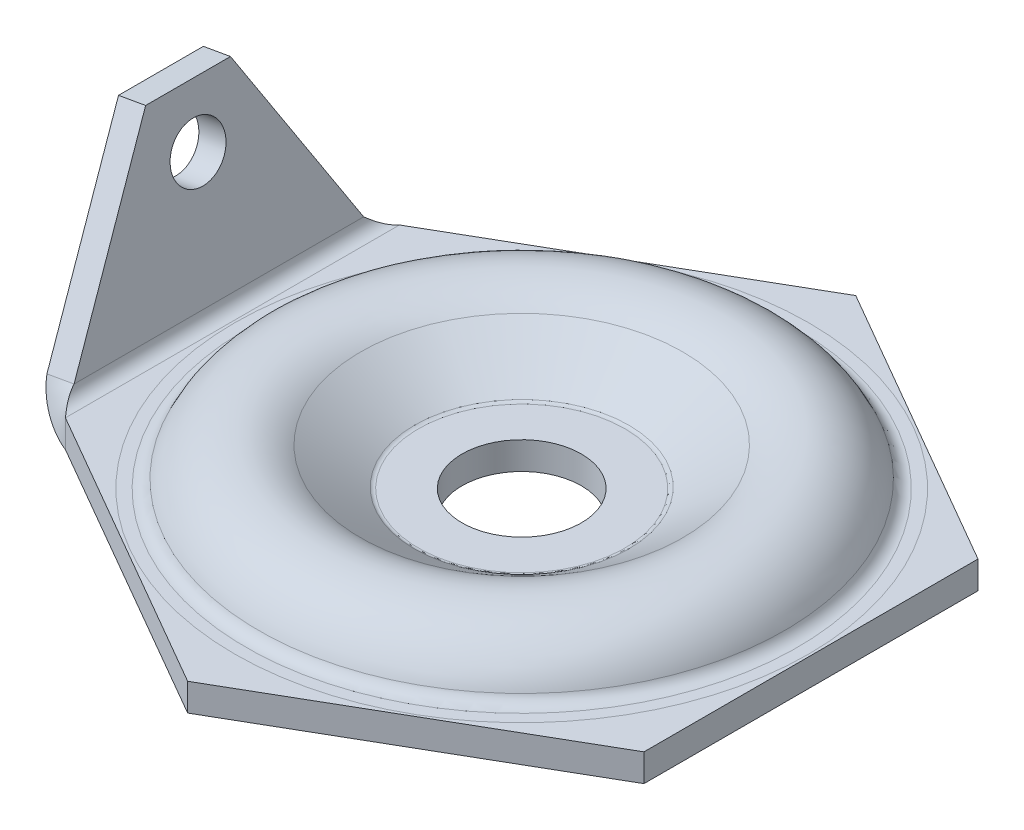
ISO-10303-21;
HEADER;
FILE_DESCRIPTION(('STEP AP214'),'2;1');
FILE_NAME('part.step','',(''),(''),'','','');
FILE_SCHEMA(('AUTOMOTIVE_DESIGN { 1 0 10303 214 1 1 1 1 }'));
ENDSEC;
DATA;
#1=APPLICATION_CONTEXT('core data for automotive mechanical design processes');
#2=APPLICATION_PROTOCOL_DEFINITION('international standard','automotive_design',2000,#1);
#3=PRODUCT_CONTEXT('',#1,'mechanical');
#4=PRODUCT('Part','Part','',(#3));
#5=PRODUCT_RELATED_PRODUCT_CATEGORY('part','',(#4));
#6=PRODUCT_DEFINITION_FORMATION('','',#4);
#7=PRODUCT_DEFINITION_CONTEXT('part definition',#1,'design');
#8=PRODUCT_DEFINITION('design','',#6,#7);
#9=PRODUCT_DEFINITION_SHAPE('','',#8);
#10=(LENGTH_UNIT() NAMED_UNIT(*) SI_UNIT(.MILLI.,.METRE.));
#11=(NAMED_UNIT(*) PLANE_ANGLE_UNIT() SI_UNIT($,.RADIAN.));
#12=(NAMED_UNIT(*) SI_UNIT($,.STERADIAN.) SOLID_ANGLE_UNIT());
#13=UNCERTAINTY_MEASURE_WITH_UNIT(LENGTH_MEASURE(1.E-05),#10,'distance_accuracy_value','');
#14=(GEOMETRIC_REPRESENTATION_CONTEXT(3) GLOBAL_UNCERTAINTY_ASSIGNED_CONTEXT((#13)) GLOBAL_UNIT_ASSIGNED_CONTEXT((#10,
#11,#12)) REPRESENTATION_CONTEXT('',''));
#15=CARTESIAN_POINT('',(0.,0.,0.));
#16=DIRECTION('',(0.,0.,1.));
#17=DIRECTION('',(1.,0.,0.));
#18=AXIS2_PLACEMENT_3D('',#15,#16,#17);
#19=CARTESIAN_POINT('',(0.,0.,0.));
#20=DIRECTION('',(0.,-1.,0.));
#21=DIRECTION('',(0.,0.,-1.));
#22=AXIS2_PLACEMENT_3D('',#19,#20,#21);
#23=CYLINDRICAL_SURFACE('',#22,13.);
#24=CARTESIAN_POINT('',(0.,0.,0.));
#25=DIRECTION('',(0.,-1.,0.));
#26=DIRECTION('',(0.,0.,-1.));
#27=AXIS2_PLACEMENT_3D('',#24,#25,#26);
#28=CIRCLE('',#27,13.);
#29=CARTESIAN_POINT('',(0.,0.,-13.));
#30=VERTEX_POINT('',#29);
#31=EDGE_CURVE('E12',#30,#30,#28,.T.);
#32=ORIENTED_EDGE('',*,*,#31,.T.);
#33=EDGE_LOOP('',(#32));
#34=FACE_BOUND('',#33,.T.);
#35=CARTESIAN_POINT('',(0.,6.,0.));
#36=DIRECTION('',(0.,-1.,0.));
#37=DIRECTION('',(0.,0.,-1.));
#38=AXIS2_PLACEMENT_3D('',#35,#36,#37);
#39=CIRCLE('',#38,13.);
#40=CARTESIAN_POINT('',(0.,6.,-13.));
#41=VERTEX_POINT('',#40);
#42=EDGE_CURVE('E121',#41,#41,#39,.T.);
#43=ORIENTED_EDGE('',*,*,#42,.F.);
#44=EDGE_LOOP('',(#43));
#45=FACE_BOUND('',#44,.T.);
#46=ADVANCED_FACE('F75',(#34,#45),#23,.F.);
#47=CARTESIAN_POINT('',(13.,0.,0.));
#48=DIRECTION('',(0.,-1.,0.));
#49=DIRECTION('',(0.,0.,-1.));
#50=AXIS2_PLACEMENT_3D('',#47,#48,#49);
#51=PLANE('',#50);
#52=CARTESIAN_POINT('',(0.,0.,0.));
#53=DIRECTION('',(0.,-1.,0.));
#54=DIRECTION('',(0.,0.,-1.));
#55=AXIS2_PLACEMENT_3D('',#52,#53,#54);
#56=CIRCLE('',#55,22.5);
#57=CARTESIAN_POINT('',(0.,0.,-22.5));
#58=VERTEX_POINT('',#57);
#59=EDGE_CURVE('E81',#58,#58,#56,.T.);
#60=ORIENTED_EDGE('',*,*,#59,.T.);
#61=EDGE_LOOP('',(#60));
#62=FACE_BOUND('',#61,.T.);
#63=ORIENTED_EDGE('',*,*,#31,.F.);
#64=EDGE_LOOP('',(#63));
#65=FACE_BOUND('',#64,.T.);
#66=ADVANCED_FACE('F129',(#62,#65),#51,.T.);
#67=CARTESIAN_POINT('',(0.,7.5,0.));
#68=DIRECTION('',(0.,-1.,0.));
#69=DIRECTION('',(0.,0.,-1.));
#70=AXIS2_PLACEMENT_3D('',#67,#68,#69);
#71=TOROIDAL_SURFACE('',#70,22.5,7.5);
#72=CARTESIAN_POINT('',(0.,1.29305055803008,0.));
#73=DIRECTION('',(0.,-1.,0.));
#74=DIRECTION('',(0.,0.,-1.));
#75=AXIS2_PLACEMENT_3D('',#72,#73,#74);
#76=CIRCLE('',#75,26.7099618317544);
#77=CARTESIAN_POINT('',(0.,1.29305055803008,-26.7099618317544));
#78=VERTEX_POINT('',#77);
#79=EDGE_CURVE('E85',#78,#78,#76,.T.);
#80=ORIENTED_EDGE('',*,*,#79,.T.);
#81=EDGE_LOOP('',(#80));
#82=FACE_BOUND('',#81,.T.);
#83=ORIENTED_EDGE('',*,*,#59,.F.);
#84=EDGE_LOOP('',(#83));
#85=FACE_BOUND('',#84,.T.);
#86=ADVANCED_FACE('F133',(#82,#85),#71,.T.);
#87=CARTESIAN_POINT('',(0.,1.29305055803008,0.));
#88=DIRECTION('',(0.,1.,0.));
#89=DIRECTION('',(0.,0.,1.));
#90=AXIS2_PLACEMENT_3D('',#87,#88,#89);
#91=CONICAL_SURFACE('',#90,26.7099618317544,0.974806450608682);
#92=CARTESIAN_POINT('',(0.,9.25459204539484,0.));
#93=DIRECTION('',(0.,-1.,0.));
#94=DIRECTION('',(0.,0.,-1.));
#95=AXIS2_PLACEMENT_3D('',#92,#93,#94);
#96=CIRCLE('',#95,38.4480458018947);
#97=CARTESIAN_POINT('',(0.,9.25459204539484,-38.4480458018947));
#98=VERTEX_POINT('',#97);
#99=EDGE_CURVE('E89',#98,#98,#96,.T.);
#100=ORIENTED_EDGE('',*,*,#99,.T.);
#101=EDGE_LOOP('',(#100));
#102=FACE_BOUND('',#101,.T.);
#103=ORIENTED_EDGE('',*,*,#79,.F.);
#104=EDGE_LOOP('',(#103));
#105=FACE_BOUND('',#104,.T.);
#106=ADVANCED_FACE('F137',(#102,#105),#91,.T.);
#107=CARTESIAN_POINT('',(0.,1.80625271503094,0.));
#108=DIRECTION('',(0.,-1.,0.));
#109=DIRECTION('',(0.,0.,-1.));
#110=AXIS2_PLACEMENT_3D('',#107,#108,#109);
#111=TOROIDAL_SURFACE('',#110,43.5,8.99999999999999);
#112=CARTESIAN_POINT('',(0.,5.40312635751546,0.));
#113=DIRECTION('',(0.,-1.,0.));
#114=DIRECTION('',(0.,0.,-1.));
#115=AXIS2_PLACEMENT_3D('',#112,#113,#114);
#116=CIRCLE('',#115,51.75);
#117=CARTESIAN_POINT('',(0.,5.40312635751546,-51.75));
#118=VERTEX_POINT('',#117);
#119=EDGE_CURVE('E94',#118,#118,#116,.T.);
#120=ORIENTED_EDGE('',*,*,#119,.T.);
#121=EDGE_LOOP('',(#120));
#122=FACE_BOUND('',#121,.T.);
#123=ORIENTED_EDGE('',*,*,#99,.F.);
#124=EDGE_LOOP('',(#123));
#125=FACE_BOUND('',#124,.T.);
#126=ADVANCED_FACE('F144',(#122,#125),#111,.F.);
#127=CARTESIAN_POINT('',(0.,9.,0.));
#128=DIRECTION('',(0.,-1.,0.));
#129=DIRECTION('',(0.,0.,-1.));
#130=AXIS2_PLACEMENT_3D('',#127,#128,#129);
#131=TOROIDAL_SURFACE('',#130,60.,9.00000000000001);
#132=CARTESIAN_POINT('',(0.,0.,0.));
#133=DIRECTION('',(0.,-1.,0.));
#134=DIRECTION('',(0.,0.,-1.));
#135=AXIS2_PLACEMENT_3D('',#132,#133,#134);
#136=CIRCLE('',#135,60.);
#137=CARTESIAN_POINT('',(0.,0.,-60.));
#138=VERTEX_POINT('',#137);
#139=EDGE_CURVE('E97',#138,#138,#136,.T.);
#140=ORIENTED_EDGE('',*,*,#139,.T.);
#141=EDGE_LOOP('',(#140));
#142=FACE_BOUND('',#141,.T.);
#143=ORIENTED_EDGE('',*,*,#119,.F.);
#144=EDGE_LOOP('',(#143));
#145=FACE_BOUND('',#144,.T.);
#146=ADVANCED_FACE('F148',(#142,#145),#131,.T.);
#147=CARTESIAN_POINT('',(60.,0.,0.));
#148=DIRECTION('',(0.,-1.,0.));
#149=DIRECTION('',(0.,0.,-1.));
#150=AXIS2_PLACEMENT_3D('',#147,#148,#149);
#151=PLANE('',#150);
#152=CARTESIAN_POINT('',(0.,0.,0.));
#153=DIRECTION('',(0.,-1.,0.));
#154=DIRECTION('',(0.,0.,-1.));
#155=AXIS2_PLACEMENT_3D('',#152,#153,#154);
#156=CIRCLE('',#155,62.5);
#157=CARTESIAN_POINT('',(0.,0.,-62.5));
#158=VERTEX_POINT('',#157);
#159=EDGE_CURVE('E100',#158,#158,#156,.T.);
#160=ORIENTED_EDGE('',*,*,#159,.T.);
#161=EDGE_LOOP('',(#160));
#162=FACE_BOUND('',#161,.T.);
#163=ORIENTED_EDGE('',*,*,#139,.F.);
#164=EDGE_LOOP('',(#163));
#165=FACE_BOUND('',#164,.T.);
#166=ADVANCED_FACE('F152',(#162,#165),#151,.T.);
#167=CARTESIAN_POINT('',(0.,0.,0.));
#168=DIRECTION('',(0.,-1.,0.));
#169=DIRECTION('',(0.,0.,-1.));
#170=AXIS2_PLACEMENT_3D('',#167,#168,#169);
#171=CYLINDRICAL_SURFACE('',#170,62.5);
#172=CARTESIAN_POINT('',(0.,6.,0.));
#173=DIRECTION('',(0.,-1.,0.));
#174=DIRECTION('',(0.,0.,-1.));
#175=AXIS2_PLACEMENT_3D('',#172,#173,#174);
#176=CIRCLE('',#175,62.5);
#177=CARTESIAN_POINT('',(0.,6.,-62.5));
#178=VERTEX_POINT('',#177);
#179=EDGE_CURVE('E103',#178,#178,#176,.T.);
#180=ORIENTED_EDGE('',*,*,#179,.T.);
#181=EDGE_LOOP('',(#180));
#182=FACE_BOUND('',#181,.T.);
#183=ORIENTED_EDGE('',*,*,#159,.F.);
#184=EDGE_LOOP('',(#183));
#185=FACE_BOUND('',#184,.T.);
#186=ADVANCED_FACE('F156',(#182,#185),#171,.T.);
#187=CARTESIAN_POINT('',(62.5,6.,0.));
#188=DIRECTION('',(0.,1.,0.));
#189=DIRECTION('',(0.,0.,1.));
#190=AXIS2_PLACEMENT_3D('',#187,#188,#189);
#191=PLANE('',#190);
#192=CARTESIAN_POINT('',(0.,6.,0.));
#193=DIRECTION('',(0.,-1.,0.));
#194=DIRECTION('',(0.,0.,-1.));
#195=AXIS2_PLACEMENT_3D('',#192,#193,#194);
#196=CIRCLE('',#195,60.);
#197=CARTESIAN_POINT('',(0.,6.,-60.));
#198=VERTEX_POINT('',#197);
#199=EDGE_CURVE('E106',#198,#198,#196,.T.);
#200=ORIENTED_EDGE('',*,*,#199,.T.);
#201=EDGE_LOOP('',(#200));
#202=FACE_BOUND('',#201,.T.);
#203=ORIENTED_EDGE('',*,*,#179,.F.);
#204=EDGE_LOOP('',(#203));
#205=FACE_BOUND('',#204,.T.);
#206=ADVANCED_FACE('F160',(#202,#205),#191,.T.);
#207=CARTESIAN_POINT('',(0.,9.,0.));
#208=DIRECTION('',(0.,-1.,0.));
#209=DIRECTION('',(0.,0.,-1.));
#210=AXIS2_PLACEMENT_3D('',#207,#208,#209);
#211=TOROIDAL_SURFACE('',#210,60.,3.);
#212=CARTESIAN_POINT('',(0.,7.80104211917182,0.));
#213=DIRECTION('',(0.,-1.,0.));
#214=DIRECTION('',(0.,0.,-1.));
#215=AXIS2_PLACEMENT_3D('',#212,#213,#214);
#216=CIRCLE('',#215,57.25);
#217=CARTESIAN_POINT('',(0.,7.80104211917182,-57.25));
#218=VERTEX_POINT('',#217);
#219=EDGE_CURVE('E109',#218,#218,#216,.T.);
#220=ORIENTED_EDGE('',*,*,#219,.T.);
#221=EDGE_LOOP('',(#220));
#222=FACE_BOUND('',#221,.T.);
#223=ORIENTED_EDGE('',*,*,#199,.F.);
#224=EDGE_LOOP('',(#223));
#225=FACE_BOUND('',#224,.T.);
#226=ADVANCED_FACE('F164',(#222,#225),#211,.F.);
#227=CARTESIAN_POINT('',(0.,1.80625271503094,0.));
#228=DIRECTION('',(0.,-1.,0.));
#229=DIRECTION('',(0.,0.,-1.));
#230=AXIS2_PLACEMENT_3D('',#227,#228,#229);
#231=TOROIDAL_SURFACE('',#230,43.5,15.);
#232=CARTESIAN_POINT('',(0.,14.2201515989708,0.));
#233=DIRECTION('',(0.,-1.,0.));
#234=DIRECTION('',(0.,0.,-1.));
#235=AXIS2_PLACEMENT_3D('',#232,#233,#234);
#236=CIRCLE('',#235,35.0800763364911);
#237=CARTESIAN_POINT('',(0.,14.2201515989708,-35.0800763364911));
#238=VERTEX_POINT('',#237);
#239=EDGE_CURVE('E112',#238,#238,#236,.T.);
#240=ORIENTED_EDGE('',*,*,#239,.T.);
#241=EDGE_LOOP('',(#240));
#242=FACE_BOUND('',#241,.T.);
#243=ORIENTED_EDGE('',*,*,#219,.F.);
#244=EDGE_LOOP('',(#243));
#245=FACE_BOUND('',#244,.T.);
#246=ADVANCED_FACE('F168',(#242,#245),#231,.T.);
#247=CARTESIAN_POINT('',(0.,14.2201515989708,0.));
#248=DIRECTION('',(0.,1.,0.));
#249=DIRECTION('',(0.,0.,1.));
#250=AXIS2_PLACEMENT_3D('',#247,#248,#249);
#251=CONICAL_SURFACE('',#250,35.0800763364911,0.974806450608682);
#252=CARTESIAN_POINT('',(0.,6.25861011160602,0.));
#253=DIRECTION('',(0.,-1.,0.));
#254=DIRECTION('',(0.,0.,-1.));
#255=AXIS2_PLACEMENT_3D('',#252,#253,#254);
#256=CIRCLE('',#255,23.3419923663509);
#257=CARTESIAN_POINT('',(0.,6.25861011160602,-23.3419923663509));
#258=VERTEX_POINT('',#257);
#259=EDGE_CURVE('E115',#258,#258,#256,.T.);
#260=ORIENTED_EDGE('',*,*,#259,.T.);
#261=EDGE_LOOP('',(#260));
#262=FACE_BOUND('',#261,.T.);
#263=ORIENTED_EDGE('',*,*,#239,.F.);
#264=EDGE_LOOP('',(#263));
#265=FACE_BOUND('',#264,.T.);
#266=ADVANCED_FACE('F172',(#262,#265),#251,.F.);
#267=CARTESIAN_POINT('',(0.,7.5,0.));
#268=DIRECTION('',(0.,-1.,0.));
#269=DIRECTION('',(0.,0.,-1.));
#270=AXIS2_PLACEMENT_3D('',#267,#268,#269);
#271=TOROIDAL_SURFACE('',#270,22.5,1.5);
#272=CARTESIAN_POINT('',(0.,6.,0.));
#273=DIRECTION('',(0.,-1.,0.));
#274=DIRECTION('',(0.,0.,-1.));
#275=AXIS2_PLACEMENT_3D('',#272,#273,#274);
#276=CIRCLE('',#275,22.5);
#277=CARTESIAN_POINT('',(0.,6.,-22.5));
#278=VERTEX_POINT('',#277);
#279=EDGE_CURVE('E118',#278,#278,#276,.T.);
#280=ORIENTED_EDGE('',*,*,#279,.T.);
#281=EDGE_LOOP('',(#280));
#282=FACE_BOUND('',#281,.T.);
#283=ORIENTED_EDGE('',*,*,#259,.F.);
#284=EDGE_LOOP('',(#283));
#285=FACE_BOUND('',#284,.T.);
#286=ADVANCED_FACE('F176',(#282,#285),#271,.F.);
#287=CARTESIAN_POINT('',(13.,6.,0.));
#288=DIRECTION('',(0.,1.,0.));
#289=DIRECTION('',(0.,0.,1.));
#290=AXIS2_PLACEMENT_3D('',#287,#288,#289);
#291=PLANE('',#290);
#292=ORIENTED_EDGE('',*,*,#42,.T.);
#293=EDGE_LOOP('',(#292));
#294=FACE_BOUND('',#293,.T.);
#295=ORIENTED_EDGE('',*,*,#279,.F.);
#296=EDGE_LOOP('',(#295));
#297=FACE_BOUND('',#296,.T.);
#298=ADVANCED_FACE('F125',(#294,#297),#291,.T.);
#299=CLOSED_SHELL('',(#46,#66,#86,#106,#126,#146,#166,#186,#206,#226,#246,#266,#286,#298));
#300=MANIFOLD_SOLID_BREP('B2',#299);
#301=CARTESIAN_POINT('',(-53.5598364946397,-61.8141391116004,0.));
#302=DIRECTION('',(0.984807753012209,0.173648177666927,0.));
#303=DIRECTION('',(0.,0.,1.));
#304=AXIS2_PLACEMENT_3D('',#301,#302,#303);
#305=PLANE('',#304);
#306=CARTESIAN_POINT('',(-70.4905338171652,34.20461680709,0.));
#307=DIRECTION('',(0.984807753012209,0.173648177666927,0.));
#308=DIRECTION('',(0.,0.,1.));
#309=AXIS2_PLACEMENT_3D('',#306,#307,#308);
#310=CIRCLE('',#309,6.);
#311=CARTESIAN_POINT('',(-70.4905338171652,34.20461680709,6.00000000000002));
#312=VERTEX_POINT('',#311);
#313=EDGE_CURVE('E391',#312,#312,#310,.T.);
#314=ORIENTED_EDGE('',*,*,#313,.F.);
#315=EDGE_LOOP('',(#314));
#316=FACE_BOUND('',#315,.T.);
#317=DIRECTION('',(0.150383733180433,-0.852868531952444,0.5));
#318=VECTOR('',#317,1.);
#319=CARTESIAN_POINT('',(-64.4996716876562,0.228749328168756,36.3730669589464));
#320=LINE('',#319,#318);
#321=CARTESIAN_POINT('',(-72.6611360380018,46.5147137197426,9.23760430703401));
#322=VERTEX_POINT('',#321);
#323=CARTESIAN_POINT('',(-65.9544232590366,8.47905546699922,31.5362686543219));
#324=VERTEX_POINT('',#323);
#325=EDGE_CURVE('E349',#322,#324,#320,.T.);
#326=ORIENTED_EDGE('',*,*,#325,.T.);
#327=DIRECTION('',(0.,0.,-1.));
#328=VECTOR('',#327,1.);
#329=CARTESIAN_POINT('',(-65.9544232590366,8.47905546699922,0.));
#330=LINE('',#329,#328);
#331=CARTESIAN_POINT('',(-65.9544232590366,8.4790554669992,-31.5362686543218));
#332=VERTEX_POINT('',#331);
#333=EDGE_CURVE('E351',#324,#332,#330,.T.);
#334=ORIENTED_EDGE('',*,*,#333,.T.);
#335=DIRECTION('',(-0.150383733180433,0.852868531952443,0.5));
#336=VECTOR('',#335,1.);
#337=CARTESIAN_POINT('',(-53.5598364946397,-61.8141391116004,-72.7461339178929));
#338=LINE('',#337,#336);
#339=CARTESIAN_POINT('',(-72.6611360380018,46.5147137197426,-9.23760430703401));
#340=VERTEX_POINT('',#339);
#341=EDGE_CURVE('E337',#332,#340,#338,.T.);
#342=ORIENTED_EDGE('',*,*,#341,.T.);
#343=DIRECTION('',(0.,0.,1.));
#344=VECTOR('',#343,1.);
#345=CARTESIAN_POINT('',(-72.6611360380018,46.5147137197426,9.23760430703401));
#346=LINE('',#345,#344);
#347=EDGE_CURVE('E313',#340,#322,#346,.T.);
#348=ORIENTED_EDGE('',*,*,#347,.T.);
#349=EDGE_LOOP('',(#326,#334,#342,#348));
#350=FACE_BOUND('',#349,.T.);
#351=ADVANCED_FACE('F287',(#316,#350),#305,.T.);
#352=CARTESIAN_POINT('',(-59.468683012713,-62.856028177602,0.));
#353=DIRECTION('',(0.984807753012209,0.173648177666927,0.));
#354=DIRECTION('',(0.,0.,1.));
#355=AXIS2_PLACEMENT_3D('',#352,#353,#354);
#356=PLANE('',#355);
#357=CARTESIAN_POINT('',(-76.3993803352384,33.1627277410884,0.));
#358=DIRECTION('',(0.984807753012209,0.173648177666927,0.));
#359=DIRECTION('',(0.,0.,1.));
#360=AXIS2_PLACEMENT_3D('',#357,#358,#359);
#361=CIRCLE('',#360,6.);
#362=CARTESIAN_POINT('',(-76.3993803352384,33.1627277410884,6.00000000000002));
#363=VERTEX_POINT('',#362);
#364=EDGE_CURVE('E389',#363,#363,#361,.T.);
#365=ORIENTED_EDGE('',*,*,#364,.T.);
#366=EDGE_LOOP('',(#365));
#367=FACE_BOUND('',#366,.T.);
#368=DIRECTION('',(0.,0.,-1.));
#369=VECTOR('',#368,1.);
#370=CARTESIAN_POINT('',(-71.8632697771099,7.43716640099763,0.));
#371=LINE('',#370,#369);
#372=CARTESIAN_POINT('',(-71.8632697771099,7.43716640099765,31.5362686543219));
#373=VERTEX_POINT('',#372);
#374=CARTESIAN_POINT('',(-71.8632697771099,7.43716640099765,-31.5362686543218));
#375=VERTEX_POINT('',#374);
#376=EDGE_CURVE('E297',#373,#375,#371,.T.);
#377=ORIENTED_EDGE('',*,*,#376,.F.);
#378=DIRECTION('',(0.150383733180433,-0.852868531952444,0.5));
#379=VECTOR('',#378,1.);
#380=CARTESIAN_POINT('',(-70.4085182057294,-0.813139737832813,36.3730669589464));
#381=LINE('',#380,#379);
#382=CARTESIAN_POINT('',(-78.569982556075,45.472824653741,9.23760430703401));
#383=VERTEX_POINT('',#382);
#384=EDGE_CURVE('E327',#383,#373,#381,.T.);
#385=ORIENTED_EDGE('',*,*,#384,.F.);
#386=DIRECTION('',(0.,0.,1.));
#387=VECTOR('',#386,1.);
#388=CARTESIAN_POINT('',(-78.569982556075,45.472824653741,9.23760430703401));
#389=LINE('',#388,#387);
#390=CARTESIAN_POINT('',(-78.569982556075,45.472824653741,-9.23760430703401));
#391=VERTEX_POINT('',#390);
#392=EDGE_CURVE('E331',#391,#383,#389,.T.);
#393=ORIENTED_EDGE('',*,*,#392,.F.);
#394=DIRECTION('',(-0.150383733180433,0.852868531952444,0.5));
#395=VECTOR('',#394,1.);
#396=CARTESIAN_POINT('',(-70.4085182057294,-0.813139737832813,-36.3730669589464));
#397=LINE('',#396,#395);
#398=EDGE_CURVE('E346',#375,#391,#397,.T.);
#399=ORIENTED_EDGE('',*,*,#398,.F.);
#400=EDGE_LOOP('',(#377,#385,#393,#399));
#401=FACE_BOUND('',#400,.T.);
#402=ADVANCED_FACE('F329',(#367,#401),#356,.F.);
#403=CARTESIAN_POINT('',(-64.4996716876562,0.228749328168756,-36.3730669589464));
#404=DIRECTION('',(0.0868240888334637,-0.492403876506104,0.866025403784439));
#405=DIRECTION('',(0.150383733180433,-0.852868531952444,-0.5));
#406=AXIS2_PLACEMENT_3D('',#403,#404,#405);
#407=PLANE('',#406);
#408=CARTESIAN_POINT('',(-71.8632697771099,7.43716640099764,-31.5362686543218));
#409=CARTESIAN_POINT('',(-65.9544232590366,8.47905546699921,-31.5362686543218));
#410=B_SPLINE_CURVE_WITH_KNOTS('',1,(#408,#409),.UNSPECIFIED.,.F.,.F.,(2,2),(0.,1.),.UNSPECIFIED.);
#411=EDGE_CURVE('E73',#375,#332,#410,.T.);
#412=ORIENTED_EDGE('',*,*,#411,.F.);
#413=ORIENTED_EDGE('',*,*,#398,.T.);
#414=DIRECTION('',(-0.984807753012209,-0.173648177666927,0.));
#415=VECTOR('',#414,1.);
#416=CARTESIAN_POINT('',(-72.6611360380018,46.5147137197426,-9.23760430703401));
#417=LINE('',#416,#415);
#418=EDGE_CURVE('E345',#340,#391,#417,.T.);
#419=ORIENTED_EDGE('',*,*,#418,.F.);
#420=ORIENTED_EDGE('',*,*,#341,.F.);
#421=EDGE_LOOP('',(#412,#413,#419,#420));
#422=FACE_BOUND('',#421,.T.);
#423=ADVANCED_FACE('F289',(#422),#407,.F.);
#424=CARTESIAN_POINT('',(-72.6611360380018,46.5147137197426,9.23760430703401));
#425=DIRECTION('',(0.173648177666927,-0.984807753012209,0.));
#426=DIRECTION('',(0.,0.,-1.));
#427=AXIS2_PLACEMENT_3D('',#424,#425,#426);
#428=PLANE('',#427);
#429=ORIENTED_EDGE('',*,*,#392,.T.);
#430=DIRECTION('',(-0.984807753012209,-0.173648177666927,0.));
#431=VECTOR('',#430,1.);
#432=CARTESIAN_POINT('',(-72.6611360380018,46.5147137197426,9.23760430703401));
#433=LINE('',#432,#431);
#434=EDGE_CURVE('E342',#322,#383,#433,.T.);
#435=ORIENTED_EDGE('',*,*,#434,.F.);
#436=ORIENTED_EDGE('',*,*,#347,.F.);
#437=ORIENTED_EDGE('',*,*,#418,.T.);
#438=EDGE_LOOP('',(#429,#435,#436,#437));
#439=FACE_BOUND('',#438,.T.);
#440=ADVANCED_FACE('F341',(#439),#428,.F.);
#441=CARTESIAN_POINT('',(-64.4996716876562,0.228749328168756,36.3730669589464));
#442=DIRECTION('',(0.0868240888334637,-0.492403876506104,-0.866025403784438));
#443=DIRECTION('',(-0.150383733180433,0.852868531952444,-0.5));
#444=AXIS2_PLACEMENT_3D('',#441,#442,#443);
#445=PLANE('',#444);
#446=CARTESIAN_POINT('',(-65.9544232590366,8.47905546699922,31.5362686543219));
#447=CARTESIAN_POINT('',(-71.8632697771099,7.43716640099765,31.5362686543219));
#448=B_SPLINE_CURVE_WITH_KNOTS('',1,(#446,#447),.UNSPECIFIED.,.F.,.F.,(2,2),(0.,1.),.UNSPECIFIED.);
#449=EDGE_CURVE('E364',#373,#324,#448,.F.);
#450=ORIENTED_EDGE('',*,*,#449,.T.);
#451=ORIENTED_EDGE('',*,*,#325,.F.);
#452=ORIENTED_EDGE('',*,*,#434,.T.);
#453=ORIENTED_EDGE('',*,*,#384,.T.);
#454=EDGE_LOOP('',(#450,#451,#452,#453));
#455=FACE_BOUND('',#454,.T.);
#456=ADVANCED_FACE('F348',(#455),#445,.F.);
#457=CARTESIAN_POINT('',(-76.4141770717274,33.1601186772189,0.));
#458=DIRECTION('',(0.984807753012209,0.173648177666927,0.));
#459=DIRECTION('',(0.,0.,1.));
#460=AXIS2_PLACEMENT_3D('',#457,#458,#459);
#461=CYLINDRICAL_SURFACE('',#460,6.);
#462=ORIENTED_EDGE('',*,*,#313,.T.);
#463=EDGE_LOOP('',(#462));
#464=FACE_BOUND('',#463,.T.);
#465=ORIENTED_EDGE('',*,*,#364,.F.);
#466=EDGE_LOOP('',(#465));
#467=FACE_BOUND('',#466,.T.);
#468=ADVANCED_FACE('F377',(#464,#467),#461,.F.);
#469=CARTESIAN_POINT('',(0.,6.,0.));
#470=DIRECTION('',(0.,-1.,0.));
#471=DIRECTION('',(0.,0.,-1.));
#472=AXIS2_PLACEMENT_3D('',#469,#470,#471);
#473=CYLINDRICAL_SURFACE('',#472,62.5);
#474=CARTESIAN_POINT('',(0.,6.,0.));
#475=DIRECTION('',(0.,1.,0.));
#476=DIRECTION('',(0.,0.,1.));
#477=AXIS2_PLACEMENT_3D('',#474,#475,#476);
#478=CIRCLE('',#477,62.5);
#479=CARTESIAN_POINT('',(0.,6.,62.5));
#480=VERTEX_POINT('',#479);
#481=EDGE_CURVE('E615',#480,#480,#478,.T.);
#482=ORIENTED_EDGE('',*,*,#481,.T.);
#483=EDGE_LOOP('',(#482));
#484=FACE_BOUND('',#483,.T.);
#485=CARTESIAN_POINT('',(0.,0.,0.));
#486=DIRECTION('',(0.,1.,0.));
#487=DIRECTION('',(0.,0.,1.));
#488=AXIS2_PLACEMENT_3D('',#485,#486,#487);
#489=CIRCLE('',#488,62.5);
#490=CARTESIAN_POINT('',(0.,0.,62.5));
#491=VERTEX_POINT('',#490);
#492=EDGE_CURVE('E569',#491,#491,#489,.T.);
#493=ORIENTED_EDGE('',*,*,#492,.F.);
#494=EDGE_LOOP('',(#493));
#495=FACE_BOUND('',#494,.T.);
#496=ADVANCED_FACE('F710',(#484,#495),#473,.F.);
#497=CARTESIAN_POINT('',(63.,6.,-36.3730669589464));
#498=DIRECTION('',(-0.5,0.,0.866025403784439));
#499=DIRECTION('',(0.866025403784439,0.,0.5));
#500=AXIS2_PLACEMENT_3D('',#497,#498,#499);
#501=PLANE('',#500);
#502=DIRECTION('',(-0.866025403784439,0.,-0.5));
#503=VECTOR('',#502,1.);
#504=CARTESIAN_POINT('',(63.,0.,-36.3730669589464));
#505=LINE('',#504,#503);
#506=CARTESIAN_POINT('',(63.,0.,-36.3730669589464));
#507=VERTEX_POINT('',#506);
#508=CARTESIAN_POINT('',(0.,0.,-72.7461339178929));
#509=VERTEX_POINT('',#508);
#510=EDGE_CURVE('E612',#507,#509,#505,.T.);
#511=ORIENTED_EDGE('',*,*,#510,.T.);
#512=DIRECTION('',(0.,-1.,0.));
#513=VECTOR('',#512,1.);
#514=CARTESIAN_POINT('',(0.,6.,-72.7461339178929));
#515=LINE('',#514,#513);
#516=CARTESIAN_POINT('',(0.,6.,-72.7461339178929));
#517=VERTEX_POINT('',#516);
#518=EDGE_CURVE('E395',#517,#509,#515,.T.);
#519=ORIENTED_EDGE('',*,*,#518,.F.);
#520=DIRECTION('',(-0.866025403784439,0.,-0.5));
#521=VECTOR('',#520,1.);
#522=CARTESIAN_POINT('',(63.,6.,-36.3730669589464));
#523=LINE('',#522,#521);
#524=CARTESIAN_POINT('',(63.,6.,-36.3730669589464));
#525=VERTEX_POINT('',#524);
#526=EDGE_CURVE('E581',#525,#517,#523,.T.);
#527=ORIENTED_EDGE('',*,*,#526,.F.);
#528=DIRECTION('',(0.,-1.,0.));
#529=VECTOR('',#528,1.);
#530=CARTESIAN_POINT('',(63.,6.,-36.3730669589464));
#531=LINE('',#530,#529);
#532=EDGE_CURVE('E609',#525,#507,#531,.T.);
#533=ORIENTED_EDGE('',*,*,#532,.T.);
#534=EDGE_LOOP('',(#511,#519,#527,#533));
#535=FACE_BOUND('',#534,.T.);
#536=ADVANCED_FACE('F702',(#535),#501,.F.);
#537=CARTESIAN_POINT('',(63.,6.,36.3730669589464));
#538=DIRECTION('',(-1.,0.,0.));
#539=DIRECTION('',(0.,0.,1.));
#540=AXIS2_PLACEMENT_3D('',#537,#538,#539);
#541=PLANE('',#540);
#542=DIRECTION('',(0.,0.,-1.));
#543=VECTOR('',#542,1.);
#544=CARTESIAN_POINT('',(63.,0.,36.3730669589464));
#545=LINE('',#544,#543);
#546=CARTESIAN_POINT('',(63.,0.,36.3730669589464));
#547=VERTEX_POINT('',#546);
#548=EDGE_CURVE('E606',#547,#507,#545,.T.);
#549=ORIENTED_EDGE('',*,*,#548,.T.);
#550=ORIENTED_EDGE('',*,*,#532,.F.);
#551=DIRECTION('',(0.,0.,-1.));
#552=VECTOR('',#551,1.);
#553=CARTESIAN_POINT('',(63.,6.,36.3730669589464));
#554=LINE('',#553,#552);
#555=CARTESIAN_POINT('',(63.,6.,36.3730669589464));
#556=VERTEX_POINT('',#555);
#557=EDGE_CURVE('E586',#556,#525,#554,.T.);
#558=ORIENTED_EDGE('',*,*,#557,.F.);
#559=DIRECTION('',(0.,-1.,0.));
#560=VECTOR('',#559,1.);
#561=CARTESIAN_POINT('',(63.,6.,36.3730669589464));
#562=LINE('',#561,#560);
#563=EDGE_CURVE('E603',#556,#547,#562,.T.);
#564=ORIENTED_EDGE('',*,*,#563,.T.);
#565=EDGE_LOOP('',(#549,#550,#558,#564));
#566=FACE_BOUND('',#565,.T.);
#567=ADVANCED_FACE('F695',(#566),#541,.F.);
#568=CARTESIAN_POINT('',(0.,6.,72.7461339178929));
#569=DIRECTION('',(-0.5,0.,-0.866025403784439));
#570=DIRECTION('',(-0.866025403784439,0.,0.5));
#571=AXIS2_PLACEMENT_3D('',#568,#569,#570);
#572=PLANE('',#571);
#573=DIRECTION('',(0.866025403784439,0.,-0.5));
#574=VECTOR('',#573,1.);
#575=CARTESIAN_POINT('',(0.,0.,72.7461339178929));
#576=LINE('',#575,#574);
#577=CARTESIAN_POINT('',(0.,0.,72.7461339178929));
#578=VERTEX_POINT('',#577);
#579=EDGE_CURVE('E600',#578,#547,#576,.T.);
#580=ORIENTED_EDGE('',*,*,#579,.T.);
#581=ORIENTED_EDGE('',*,*,#563,.F.);
#582=DIRECTION('',(0.866025403784439,0.,-0.5));
#583=VECTOR('',#582,1.);
#584=CARTESIAN_POINT('',(0.,6.,72.7461339178929));
#585=LINE('',#584,#583);
#586=CARTESIAN_POINT('',(0.,6.,72.7461339178929));
#587=VERTEX_POINT('',#586);
#588=EDGE_CURVE('E589',#587,#556,#585,.T.);
#589=ORIENTED_EDGE('',*,*,#588,.F.);
#590=DIRECTION('',(0.,-1.,0.));
#591=VECTOR('',#590,1.);
#592=CARTESIAN_POINT('',(0.,6.,72.7461339178929));
#593=LINE('',#592,#591);
#594=EDGE_CURVE('E595',#587,#578,#593,.T.);
#595=ORIENTED_EDGE('',*,*,#594,.T.);
#596=EDGE_LOOP('',(#580,#581,#589,#595));
#597=FACE_BOUND('',#596,.T.);
#598=ADVANCED_FACE('F689',(#597),#572,.F.);
#599=CARTESIAN_POINT('',(0.,6.,0.));
#600=DIRECTION('',(0.,1.,0.));
#601=DIRECTION('',(0.,0.,1.));
#602=AXIS2_PLACEMENT_3D('',#599,#600,#601);
#603=PLANE('',#602);
#604=DIRECTION('',(0.,0.,-1.));
#605=VECTOR('',#604,1.);
#606=CARTESIAN_POINT('',(-63.,6.,0.));
#607=LINE('',#606,#605);
#608=CARTESIAN_POINT('',(-63.,6.,36.3730669589464));
#609=VERTEX_POINT('',#608);
#610=CARTESIAN_POINT('',(-63.,6.,-36.3730669589464));
#611=VERTEX_POINT('',#610);
#612=EDGE_CURVE('E618',#609,#611,#607,.T.);
#613=ORIENTED_EDGE('',*,*,#612,.F.);
#614=DIRECTION('',(0.866025403784439,0.,0.5));
#615=VECTOR('',#614,1.);
#616=CARTESIAN_POINT('',(-63.,6.,36.3730669589464));
#617=LINE('',#616,#615);
#618=EDGE_CURVE('E592',#609,#587,#617,.T.);
#619=ORIENTED_EDGE('',*,*,#618,.T.);
#620=ORIENTED_EDGE('',*,*,#588,.T.);
#621=ORIENTED_EDGE('',*,*,#557,.T.);
#622=ORIENTED_EDGE('',*,*,#526,.T.);
#623=DIRECTION('',(-0.866025403784438,0.,0.5));
#624=VECTOR('',#623,1.);
#625=CARTESIAN_POINT('',(0.,6.,-72.7461339178929));
#626=LINE('',#625,#624);
#627=EDGE_CURVE('E576',#517,#611,#626,.T.);
#628=ORIENTED_EDGE('',*,*,#627,.T.);
#629=EDGE_LOOP('',(#613,#619,#620,#621,#622,#628));
#630=FACE_BOUND('',#629,.T.);
#631=ORIENTED_EDGE('',*,*,#481,.F.);
#632=EDGE_LOOP('',(#631));
#633=FACE_BOUND('',#632,.T.);
#634=ADVANCED_FACE('F542',(#630,#633),#603,.T.);
#635=CARTESIAN_POINT('',(-63.,6.,36.3730669589464));
#636=DIRECTION('',(0.5,0.,-0.866025403784438));
#637=DIRECTION('',(-0.866025403784439,0.,-0.5));
#638=AXIS2_PLACEMENT_3D('',#635,#636,#637);
#639=PLANE('',#638);
#640=ORIENTED_EDGE('',*,*,#618,.F.);
#641=CARTESIAN_POINT('',(-63.,0.,36.3730669589464));
#642=CARTESIAN_POINT('',(-63.,6.,36.3730669589464));
#643=B_SPLINE_CURVE_WITH_KNOTS('',1,(#641,#642),.UNSPECIFIED.,.F.,.F.,(2,2),(0.,1.),.UNSPECIFIED.);
#644=CARTESIAN_POINT('',(-63.,0.,36.3730669589465));
#645=VERTEX_POINT('',#644);
#646=EDGE_CURVE('E447',#645,#609,#643,.T.);
#647=ORIENTED_EDGE('',*,*,#646,.F.);
#648=DIRECTION('',(0.866025403784439,0.,0.5));
#649=VECTOR('',#648,1.);
#650=CARTESIAN_POINT('',(-63.,0.,36.3730669589464));
#651=LINE('',#650,#649);
#652=EDGE_CURVE('E574',#645,#578,#651,.T.);
#653=ORIENTED_EDGE('',*,*,#652,.T.);
#654=ORIENTED_EDGE('',*,*,#594,.F.);
#655=EDGE_LOOP('',(#640,#647,#653,#654));
#656=FACE_BOUND('',#655,.T.);
#657=ADVANCED_FACE('F531',(#656),#639,.F.);
#658=CARTESIAN_POINT('',(0.,0.,0.));
#659=DIRECTION('',(0.,1.,0.));
#660=DIRECTION('',(0.,0.,1.));
#661=AXIS2_PLACEMENT_3D('',#658,#659,#660);
#662=PLANE('',#661);
#663=ORIENTED_EDGE('',*,*,#492,.T.);
#664=EDGE_LOOP('',(#663));
#665=FACE_BOUND('',#664,.T.);
#666=ORIENTED_EDGE('',*,*,#652,.F.);
#667=DIRECTION('',(0.,0.,-1.));
#668=VECTOR('',#667,1.);
#669=CARTESIAN_POINT('',(-63.,0.,0.));
#670=LINE('',#669,#668);
#671=CARTESIAN_POINT('',(-63.,0.,-36.3730669589464));
#672=VERTEX_POINT('',#671);
#673=EDGE_CURVE('E564',#645,#672,#670,.T.);
#674=ORIENTED_EDGE('',*,*,#673,.T.);
#675=DIRECTION('',(-0.866025403784439,0.,0.5));
#676=VECTOR('',#675,1.);
#677=CARTESIAN_POINT('',(-63.,0.,-36.3730669589464));
#678=LINE('',#677,#676);
#679=EDGE_CURVE('E561',#509,#672,#678,.T.);
#680=ORIENTED_EDGE('',*,*,#679,.F.);
#681=ORIENTED_EDGE('',*,*,#510,.F.);
#682=ORIENTED_EDGE('',*,*,#548,.F.);
#683=ORIENTED_EDGE('',*,*,#579,.F.);
#684=EDGE_LOOP('',(#666,#674,#680,#681,#682,#683));
#685=FACE_BOUND('',#684,.T.);
#686=ADVANCED_FACE('F541',(#665,#685),#662,.F.);
#687=CARTESIAN_POINT('',(-63.,6.,-36.3730669589464));
#688=DIRECTION('',(0.5,0.,0.866025403784439));
#689=DIRECTION('',(0.866025403784439,0.,-0.5));
#690=AXIS2_PLACEMENT_3D('',#687,#688,#689);
#691=PLANE('',#690);
#692=ORIENTED_EDGE('',*,*,#679,.T.);
#693=CARTESIAN_POINT('',(-63.,6.,-36.3730669589464));
#694=CARTESIAN_POINT('',(-63.,0.,-36.3730669589464));
#695=B_SPLINE_CURVE_WITH_KNOTS('',1,(#693,#694),.UNSPECIFIED.,.F.,.F.,(2,2),(0.,1.),.UNSPECIFIED.);
#696=EDGE_CURVE('E426',#672,#611,#695,.F.);
#697=ORIENTED_EDGE('',*,*,#696,.T.);
#698=ORIENTED_EDGE('',*,*,#627,.F.);
#699=ORIENTED_EDGE('',*,*,#518,.T.);
#700=EDGE_LOOP('',(#692,#697,#698,#699));
#701=FACE_BOUND('',#700,.T.);
#702=ADVANCED_FACE('F470',(#701),#691,.F.);
#703=CARTESIAN_POINT('',(-71.8632697771099,7.43716640099765,31.5362686543219));
#704=CARTESIAN_POINT('',(-71.6814079703803,6.4057768428097,31.9393747680026));
#705=CARTESIAN_POINT('',(-71.3178274096582,5.40689968211713,32.3424017050926));
#706=CARTESIAN_POINT('',(-70.2706298584617,3.5931003178829,33.1485347558634));
#707=CARTESIAN_POINT('',(-69.5872883521208,2.77872562273246,33.5516012812488));
#708=CARTESIAN_POINT('',(-67.9828886222369,1.43247440112594,34.3577343320195));
#709=CARTESIAN_POINT('',(-67.0622251012955,0.900929069477378,34.7608008574049));
#710=CARTESIAN_POINT('',(-65.0941374785665,0.184603756376276,35.5669339081757));
#711=CARTESIAN_POINT('',(-64.0473004046052,0.,35.9699608452657));
#712=CARTESIAN_POINT('',(-63.,0.,36.3730669589464));
#713=CARTESIAN_POINT('',(-65.9544232590366,8.47905546699922,31.5362686543219));
#714=CARTESIAN_POINT('',(-65.8938056807608,8.1352760973741,31.9393546596621));
#715=CARTESIAN_POINT('',(-65.7726091365527,7.80229989403904,32.3424017050926));
#716=CARTESIAN_POINT('',(-65.4235432861539,7.19770010596097,33.1485347558634));
#717=CARTESIAN_POINT('',(-65.1957627840403,6.92624187424416,33.5516012812488));
#718=CARTESIAN_POINT('',(-64.660962874079,6.47749146704198,34.3577343320195));
#719=CARTESIAN_POINT('',(-64.3540750337652,6.30030968982579,34.7608008574049));
#720=CARTESIAN_POINT('',(-63.6980458261888,6.06153458545876,35.5669339081757));
#721=CARTESIAN_POINT('',(-63.3490827205346,6.,35.9699809536062));
#722=CARTESIAN_POINT('',(-63.,6.,36.3730669589464));
#723=B_SPLINE_SURFACE_WITH_KNOTS('',1,3,((#703,#704,#705,#706,#707,#708,#709,#710,#711,#712),
(#713,#714,#715,#716,#717,#718,#719,#720,#721,#722)),.UNSPECIFIED.,.F.,.F.,.F.,(2,2),(4,2,2,2,
4),(0.,1.),(0.,0.25,0.5,0.75,1.),.UNSPECIFIED.);
#724=CARTESIAN_POINT('',(-71.8632697771099,7.43716640099765,31.5362686543219));
#725=CARTESIAN_POINT('',(-71.6814079703803,6.4057768428097,31.9393747680026));
#726=CARTESIAN_POINT('',(-71.3178274096582,5.40689968211713,32.3424017050926));
#727=CARTESIAN_POINT('',(-70.2706298584617,3.5931003178829,33.1485347558634));
#728=CARTESIAN_POINT('',(-69.5872883521208,2.77872562273246,33.5516012812488));
#729=CARTESIAN_POINT('',(-67.9828886222369,1.43247440112594,34.3577343320195));
#730=CARTESIAN_POINT('',(-67.0622251012955,0.900929069477378,34.7608008574049));
#731=CARTESIAN_POINT('',(-65.0941374785665,0.184603756376276,35.5669339081757));
#732=CARTESIAN_POINT('',(-64.0473004046052,0.,35.9699608452657));
#733=CARTESIAN_POINT('',(-63.,0.,36.3730669589464));
#734=B_SPLINE_CURVE_WITH_KNOTS('',3,(#724,#725,#726,#727,#728,#729,#730,#731,#732,#733),
.UNSPECIFIED.,.F.,.F.,(4,2,2,2,4),(0.,0.25,0.5,0.75,1.),.UNSPECIFIED.);
#735=EDGE_CURVE('E416',#373,#645,#734,.T.);
#736=CARTESIAN_POINT('',(-63.,6.,36.3730669589464));
#737=CARTESIAN_POINT('',(-63.3490827205346,6.,35.9699809536062));
#738=CARTESIAN_POINT('',(-63.6980458261888,6.06153458545876,35.5669339081757));
#739=CARTESIAN_POINT('',(-64.3540750337652,6.30030968982579,34.7608008574049));
#740=CARTESIAN_POINT('',(-64.660962874079,6.47749146704198,34.3577343320195));
#741=CARTESIAN_POINT('',(-65.1957627840403,6.92624187424416,33.5516012812488));
#742=CARTESIAN_POINT('',(-65.4235432861539,7.19770010596097,33.1485347558634));
#743=CARTESIAN_POINT('',(-65.7726091365527,7.80229989403904,32.3424017050926));
#744=CARTESIAN_POINT('',(-65.8938056807608,8.1352760973741,31.9393546596621));
#745=CARTESIAN_POINT('',(-65.9544232590366,8.47905546699922,31.5362686543219));
#746=B_SPLINE_CURVE_WITH_KNOTS('',3,(#736,#737,#738,#739,#740,#741,#742,#743,#744,#745),
.UNSPECIFIED.,.F.,.F.,(4,2,2,2,4),(0.,0.25,0.5,0.75,1.),.UNSPECIFIED.);
#747=EDGE_CURVE('E428',#324,#609,#746,.F.);
#748=ORIENTED_EDGE('',*,*,#449,.F.);
#749=ORIENTED_EDGE('',*,*,#735,.T.);
#750=ORIENTED_EDGE('',*,*,#646,.T.);
#751=ORIENTED_EDGE('',*,*,#747,.F.);
#752=EDGE_LOOP('',(#748,#749,#750,#751));
#753=FACE_BOUND('',#752,.T.);
#754=ADVANCED_FACE('F444',(#753),#723,.F.);
#755=CARTESIAN_POINT('',(-63.,0.,-36.3730669589464));
#756=CARTESIAN_POINT('',(-64.0473004046052,0.,-35.9699608452656));
#757=CARTESIAN_POINT('',(-65.0941374785665,0.184603756376277,-35.5669339081757));
#758=CARTESIAN_POINT('',(-67.0622251012955,0.900929069477378,-34.7608008574049));
#759=CARTESIAN_POINT('',(-67.9828886222369,1.43247440112594,-34.3577343320195));
#760=CARTESIAN_POINT('',(-69.5872883521208,2.77872562273246,-33.5516012812488));
#761=CARTESIAN_POINT('',(-70.2706298584616,3.5931003178829,-33.1485347558634));
#762=CARTESIAN_POINT('',(-71.3178274096582,5.40689968211712,-32.3424017050926));
#763=CARTESIAN_POINT('',(-71.6814079703803,6.40577684280968,-31.9393747680026));
#764=CARTESIAN_POINT('',(-71.8632697771099,7.43716640099764,-31.5362686543218));
#765=CARTESIAN_POINT('',(-63.,6.,-36.3730669589464));
#766=CARTESIAN_POINT('',(-63.3490827205347,6.,-35.9699809536062));
#767=CARTESIAN_POINT('',(-63.6980458261888,6.06153458545876,-35.5669339081757));
#768=CARTESIAN_POINT('',(-64.3540750337652,6.30030968982579,-34.7608008574049));
#769=CARTESIAN_POINT('',(-64.660962874079,6.47749146704198,-34.3577343320195));
#770=CARTESIAN_POINT('',(-65.1957627840403,6.92624187424416,-33.5516012812488));
#771=CARTESIAN_POINT('',(-65.4235432861539,7.19770010596097,-33.1485347558634));
#772=CARTESIAN_POINT('',(-65.7726091365527,7.80229989403904,-32.3424017050926));
#773=CARTESIAN_POINT('',(-65.8938056807608,8.13527609737409,-31.9393546596621));
#774=CARTESIAN_POINT('',(-65.9544232590366,8.47905546699921,-31.5362686543218));
#775=B_SPLINE_SURFACE_WITH_KNOTS('',1,3,((#755,#756,#757,#758,#759,#760,#761,#762,#763,#764),
(#765,#766,#767,#768,#769,#770,#771,#772,#773,#774)),.UNSPECIFIED.,.F.,.F.,.F.,(2,2),(4,2,2,2,
4),(0.,1.),(0.,0.25,0.5,0.75,1.),.UNSPECIFIED.);
#776=CARTESIAN_POINT('',(-63.,0.,-36.3730669589464));
#777=CARTESIAN_POINT('',(-64.0473004046052,0.,-35.9699608452656));
#778=CARTESIAN_POINT('',(-65.0941374785665,0.184603756376277,-35.5669339081757));
#779=CARTESIAN_POINT('',(-67.0622251012955,0.900929069477378,-34.7608008574049));
#780=CARTESIAN_POINT('',(-67.9828886222369,1.43247440112594,-34.3577343320195));
#781=CARTESIAN_POINT('',(-69.5872883521208,2.77872562273246,-33.5516012812488));
#782=CARTESIAN_POINT('',(-70.2706298584616,3.5931003178829,-33.1485347558634));
#783=CARTESIAN_POINT('',(-71.3178274096582,5.40689968211712,-32.3424017050926));
#784=CARTESIAN_POINT('',(-71.6814079703803,6.40577684280968,-31.9393747680026));
#785=CARTESIAN_POINT('',(-71.8632697771099,7.43716640099764,-31.5362686543218));
#786=B_SPLINE_CURVE_WITH_KNOTS('',3,(#776,#777,#778,#779,#780,#781,#782,#783,#784,#785),
.UNSPECIFIED.,.F.,.F.,(4,2,2,2,4),(0.,0.25,0.5,0.75,1.),.UNSPECIFIED.);
#787=EDGE_CURVE('E413',#672,#375,#786,.T.);
#788=CARTESIAN_POINT('',(-65.9544232590366,8.47905546699921,-31.5362686543218));
#789=CARTESIAN_POINT('',(-65.8938056807608,8.13527609737409,-31.9393546596621));
#790=CARTESIAN_POINT('',(-65.7726091365527,7.80229989403904,-32.3424017050926));
#791=CARTESIAN_POINT('',(-65.4235432861539,7.19770010596097,-33.1485347558634));
#792=CARTESIAN_POINT('',(-65.1957627840403,6.92624187424416,-33.5516012812488));
#793=CARTESIAN_POINT('',(-64.660962874079,6.47749146704198,-34.3577343320195));
#794=CARTESIAN_POINT('',(-64.3540750337652,6.30030968982579,-34.7608008574049));
#795=CARTESIAN_POINT('',(-63.6980458261888,6.06153458545876,-35.5669339081757));
#796=CARTESIAN_POINT('',(-63.3490827205347,6.,-35.9699809536062));
#797=CARTESIAN_POINT('',(-63.,6.,-36.3730669589464));
#798=B_SPLINE_CURVE_WITH_KNOTS('',3,(#788,#789,#790,#791,#792,#793,#794,#795,#796,#797),
.UNSPECIFIED.,.F.,.F.,(4,2,2,2,4),(0.,0.25,0.5,0.75,1.),.UNSPECIFIED.);
#799=EDGE_CURVE('E304',#611,#332,#798,.F.);
#800=ORIENTED_EDGE('',*,*,#787,.T.);
#801=ORIENTED_EDGE('',*,*,#411,.T.);
#802=ORIENTED_EDGE('',*,*,#799,.F.);
#803=ORIENTED_EDGE('',*,*,#696,.F.);
#804=EDGE_LOOP('',(#800,#801,#802,#803));
#805=FACE_BOUND('',#804,.T.);
#806=ADVANCED_FACE('F422',(#805),#775,.F.);
#807=CARTESIAN_POINT('',(-63.,9.,-73.4723339327047));
#808=DIRECTION('',(0.,0.,1.));
#809=DIRECTION('',(1.,0.,0.));
#810=AXIS2_PLACEMENT_3D('',#807,#808,#809);
#811=CYLINDRICAL_SURFACE('',#810,3.);
#812=ORIENTED_EDGE('',*,*,#612,.T.);
#813=ORIENTED_EDGE('',*,*,#799,.T.);
#814=ORIENTED_EDGE('',*,*,#333,.F.);
#815=ORIENTED_EDGE('',*,*,#747,.T.);
#816=EDGE_LOOP('',(#812,#813,#814,#815));
#817=FACE_BOUND('',#816,.T.);
#818=ADVANCED_FACE('F437',(#817),#811,.F.);
#819=CARTESIAN_POINT('',(-63.,9.,-73.4723339327047));
#820=DIRECTION('',(0.,0.,1.));
#821=DIRECTION('',(1.,0.,0.));
#822=AXIS2_PLACEMENT_3D('',#819,#820,#821);
#823=CYLINDRICAL_SURFACE('',#822,9.);
#824=ORIENTED_EDGE('',*,*,#673,.F.);
#825=ORIENTED_EDGE('',*,*,#735,.F.);
#826=ORIENTED_EDGE('',*,*,#376,.T.);
#827=ORIENTED_EDGE('',*,*,#787,.F.);
#828=EDGE_LOOP('',(#824,#825,#826,#827));
#829=FACE_BOUND('',#828,.T.);
#830=ADVANCED_FACE('F411',(#829),#823,.T.);
#831=CLOSED_SHELL('',(#351,#402,#423,#440,#456,#468,#496,#536,#567,#598,#634,#657,#686,#702,
#754,#806,#818,#830));
#832=MANIFOLD_SOLID_BREP('B7',#831);
#833=ADVANCED_BREP_SHAPE_REPRESENTATION('',(#18,#300,#832),#14);
#834=SHAPE_DEFINITION_REPRESENTATION(#9,#833);
ENDSEC;
END-ISO-10303-21;
